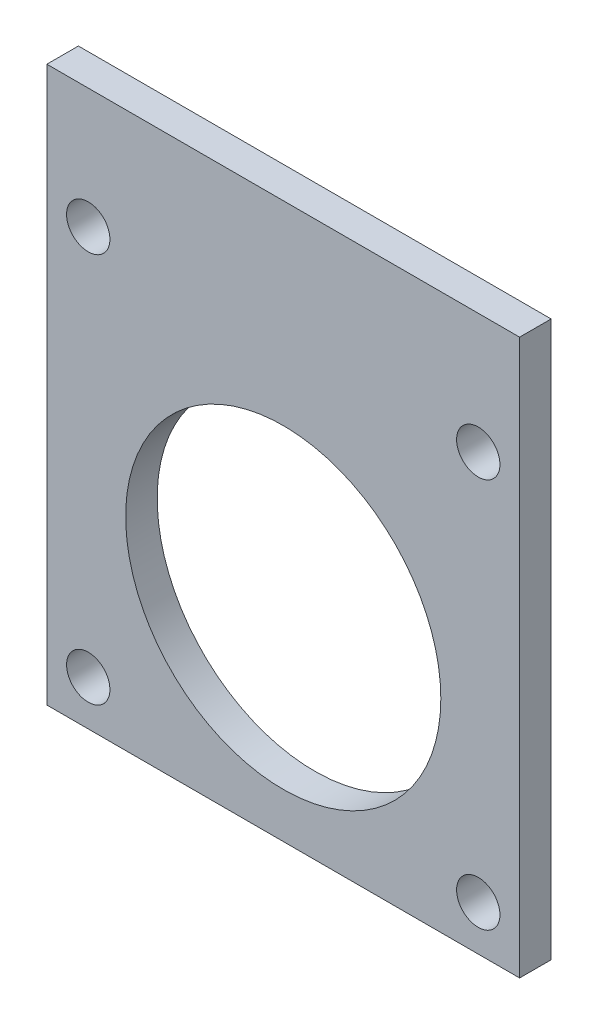
ISO-10303-21;
HEADER;
FILE_DESCRIPTION(('STEP AP214'),'2;1');
FILE_NAME('part.step','',(''),(''),'','','');
FILE_SCHEMA(('AUTOMOTIVE_DESIGN { 1 0 10303 214 1 1 1 1 }'));
ENDSEC;
DATA;
#1=APPLICATION_CONTEXT('core data for automotive mechanical design processes');
#2=APPLICATION_PROTOCOL_DEFINITION('international standard','automotive_design',2000,#1);
#3=PRODUCT_CONTEXT('',#1,'mechanical');
#4=PRODUCT('Part','Part','',(#3));
#5=PRODUCT_RELATED_PRODUCT_CATEGORY('part','',(#4));
#6=PRODUCT_DEFINITION_FORMATION('','',#4);
#7=PRODUCT_DEFINITION_CONTEXT('part definition',#1,'design');
#8=PRODUCT_DEFINITION('design','',#6,#7);
#9=PRODUCT_DEFINITION_SHAPE('','',#8);
#10=(LENGTH_UNIT() NAMED_UNIT(*) SI_UNIT(.MILLI.,.METRE.));
#11=(NAMED_UNIT(*) PLANE_ANGLE_UNIT() SI_UNIT($,.RADIAN.));
#12=(NAMED_UNIT(*) SI_UNIT($,.STERADIAN.) SOLID_ANGLE_UNIT());
#13=UNCERTAINTY_MEASURE_WITH_UNIT(LENGTH_MEASURE(1.E-05),#10,'distance_accuracy_value','');
#14=(GEOMETRIC_REPRESENTATION_CONTEXT(3) GLOBAL_UNCERTAINTY_ASSIGNED_CONTEXT((#13)) GLOBAL_UNIT_ASSIGNED_CONTEXT((#10,
#11,#12)) REPRESENTATION_CONTEXT('',''));
#15=CARTESIAN_POINT('',(0.,0.,0.));
#16=DIRECTION('',(0.,0.,1.));
#17=DIRECTION('',(1.,0.,0.));
#18=AXIS2_PLACEMENT_3D('',#15,#16,#17);
#19=CARTESIAN_POINT('',(0.,0.,4.));
#20=DIRECTION('',(0.,0.,1.));
#21=DIRECTION('',(1.,0.,0.));
#22=AXIS2_PLACEMENT_3D('',#19,#20,#21);
#23=PLANE('',#22);
#24=CARTESIAN_POINT('',(30.,-34.716194978299,4.));
#25=DIRECTION('',(0.,0.,1.));
#26=DIRECTION('',(1.,0.,0.));
#27=AXIS2_PLACEMENT_3D('',#24,#25,#26);
#28=CIRCLE('',#27,20.);
#29=CARTESIAN_POINT('',(50.,-34.716194978299,4.));
#30=VERTEX_POINT('',#29);
#31=EDGE_CURVE('E113',#30,#30,#28,.T.);
#32=ORIENTED_EDGE('',*,*,#31,.F.);
#33=EDGE_LOOP('',(#32));
#34=FACE_BOUND('',#33,.T.);
#35=CARTESIAN_POINT('',(5.25000000000001,-54.75,4.));
#36=DIRECTION('',(0.,0.,1.));
#37=DIRECTION('',(1.,0.,0.));
#38=AXIS2_PLACEMENT_3D('',#35,#36,#37);
#39=CIRCLE('',#38,2.75);
#40=CARTESIAN_POINT('',(8.00000000000001,-54.75,4.));
#41=VERTEX_POINT('',#40);
#42=EDGE_CURVE('E130',#41,#41,#39,.T.);
#43=ORIENTED_EDGE('',*,*,#42,.F.);
#44=EDGE_LOOP('',(#43));
#45=FACE_BOUND('',#44,.T.);
#46=CARTESIAN_POINT('',(5.24999999999999,-5.25,4.));
#47=DIRECTION('',(0.,0.,1.));
#48=DIRECTION('',(1.,0.,0.));
#49=AXIS2_PLACEMENT_3D('',#46,#47,#48);
#50=CIRCLE('',#49,2.75);
#51=CARTESIAN_POINT('',(7.99999999999999,-5.25,4.));
#52=VERTEX_POINT('',#51);
#53=EDGE_CURVE('E146',#52,#52,#50,.T.);
#54=ORIENTED_EDGE('',*,*,#53,.F.);
#55=EDGE_LOOP('',(#54));
#56=FACE_BOUND('',#55,.T.);
#57=DIRECTION('',(0.,-1.,0.));
#58=VECTOR('',#57,1.);
#59=CARTESIAN_POINT('',(0.,0.,4.));
#60=LINE('',#59,#58);
#61=CARTESIAN_POINT('',(0.,10.,4.));
#62=VERTEX_POINT('',#61);
#63=CARTESIAN_POINT('',(0.,-60.44,4.));
#64=VERTEX_POINT('',#63);
#65=EDGE_CURVE('E86',#62,#64,#60,.T.);
#66=ORIENTED_EDGE('',*,*,#65,.T.);
#67=DIRECTION('',(1.,0.,0.));
#68=VECTOR('',#67,1.);
#69=CARTESIAN_POINT('',(0.,-60.44,4.));
#70=LINE('',#69,#68);
#71=CARTESIAN_POINT('',(60.,-60.44,4.));
#72=VERTEX_POINT('',#71);
#73=EDGE_CURVE('E59',#64,#72,#70,.T.);
#74=ORIENTED_EDGE('',*,*,#73,.T.);
#75=DIRECTION('',(0.,1.,0.));
#76=VECTOR('',#75,1.);
#77=CARTESIAN_POINT('',(60.,0.,4.));
#78=LINE('',#77,#76);
#79=CARTESIAN_POINT('',(60.,10.,4.));
#80=VERTEX_POINT('',#79);
#81=EDGE_CURVE('E97',#72,#80,#78,.T.);
#82=ORIENTED_EDGE('',*,*,#81,.T.);
#83=DIRECTION('',(1.,0.,0.));
#84=VECTOR('',#83,1.);
#85=CARTESIAN_POINT('',(0.,10.,4.));
#86=LINE('',#85,#84);
#87=EDGE_CURVE('E94',#62,#80,#86,.T.);
#88=ORIENTED_EDGE('',*,*,#87,.F.);
#89=EDGE_LOOP('',(#66,#74,#82,#88));
#90=FACE_BOUND('',#89,.T.);
#91=CARTESIAN_POINT('',(54.75,-5.24999999999998,4.));
#92=DIRECTION('',(0.,0.,1.));
#93=DIRECTION('',(1.,0.,0.));
#94=AXIS2_PLACEMENT_3D('',#91,#92,#93);
#95=CIRCLE('',#94,2.75000000000001);
#96=CARTESIAN_POINT('',(57.5,-5.24999999999998,4.));
#97=VERTEX_POINT('',#96);
#98=EDGE_CURVE('E138',#97,#97,#95,.T.);
#99=ORIENTED_EDGE('',*,*,#98,.F.);
#100=EDGE_LOOP('',(#99));
#101=FACE_BOUND('',#100,.T.);
#102=CARTESIAN_POINT('',(54.75,-54.75,4.));
#103=DIRECTION('',(0.,0.,1.));
#104=DIRECTION('',(1.,0.,0.));
#105=AXIS2_PLACEMENT_3D('',#102,#103,#104);
#106=CIRCLE('',#105,2.75000000000001);
#107=CARTESIAN_POINT('',(57.5,-54.75,4.));
#108=VERTEX_POINT('',#107);
#109=EDGE_CURVE('E122',#108,#108,#106,.T.);
#110=ORIENTED_EDGE('',*,*,#109,.F.);
#111=EDGE_LOOP('',(#110));
#112=FACE_BOUND('',#111,.T.);
#113=ADVANCED_FACE('F41',(#34,#45,#56,#90,#101,#112),#23,.T.);
#114=CARTESIAN_POINT('',(0.,0.,0.));
#115=DIRECTION('',(0.,0.,1.));
#116=DIRECTION('',(1.,0.,0.));
#117=AXIS2_PLACEMENT_3D('',#114,#115,#116);
#118=PLANE('',#117);
#119=CARTESIAN_POINT('',(30.,-34.716194978299,0.));
#120=DIRECTION('',(0.,0.,1.));
#121=DIRECTION('',(1.,0.,0.));
#122=AXIS2_PLACEMENT_3D('',#119,#120,#121);
#123=CIRCLE('',#122,20.);
#124=CARTESIAN_POINT('',(50.,-34.716194978299,0.));
#125=VERTEX_POINT('',#124);
#126=EDGE_CURVE('E114',#125,#125,#123,.T.);
#127=ORIENTED_EDGE('',*,*,#126,.T.);
#128=EDGE_LOOP('',(#127));
#129=FACE_BOUND('',#128,.T.);
#130=DIRECTION('',(0.,-1.,0.));
#131=VECTOR('',#130,1.);
#132=CARTESIAN_POINT('',(0.,0.,0.));
#133=LINE('',#132,#131);
#134=CARTESIAN_POINT('',(0.,10.,0.));
#135=VERTEX_POINT('',#134);
#136=CARTESIAN_POINT('',(0.,-60.44,0.));
#137=VERTEX_POINT('',#136);
#138=EDGE_CURVE('E74',#135,#137,#133,.T.);
#139=ORIENTED_EDGE('',*,*,#138,.F.);
#140=DIRECTION('',(-1.,0.,0.));
#141=VECTOR('',#140,1.);
#142=CARTESIAN_POINT('',(0.,10.,0.));
#143=LINE('',#142,#141);
#144=CARTESIAN_POINT('',(60.,10.,0.));
#145=VERTEX_POINT('',#144);
#146=EDGE_CURVE('E105',#145,#135,#143,.T.);
#147=ORIENTED_EDGE('',*,*,#146,.F.);
#148=DIRECTION('',(0.,1.,0.));
#149=VECTOR('',#148,1.);
#150=CARTESIAN_POINT('',(60.,0.,0.));
#151=LINE('',#150,#149);
#152=CARTESIAN_POINT('',(60.,-60.44,0.));
#153=VERTEX_POINT('',#152);
#154=EDGE_CURVE('E91',#153,#145,#151,.T.);
#155=ORIENTED_EDGE('',*,*,#154,.F.);
#156=DIRECTION('',(1.,0.,0.));
#157=VECTOR('',#156,1.);
#158=CARTESIAN_POINT('',(0.,-60.44,0.));
#159=LINE('',#158,#157);
#160=EDGE_CURVE('E70',#137,#153,#159,.T.);
#161=ORIENTED_EDGE('',*,*,#160,.F.);
#162=EDGE_LOOP('',(#139,#147,#155,#161));
#163=FACE_BOUND('',#162,.T.);
#164=CARTESIAN_POINT('',(5.24999999999999,-5.25,0.));
#165=DIRECTION('',(0.,0.,1.));
#166=DIRECTION('',(1.,0.,0.));
#167=AXIS2_PLACEMENT_3D('',#164,#165,#166);
#168=CIRCLE('',#167,2.75);
#169=CARTESIAN_POINT('',(7.99999999999999,-5.25,0.));
#170=VERTEX_POINT('',#169);
#171=EDGE_CURVE('E142',#170,#170,#168,.T.);
#172=ORIENTED_EDGE('',*,*,#171,.T.);
#173=EDGE_LOOP('',(#172));
#174=FACE_BOUND('',#173,.T.);
#175=CARTESIAN_POINT('',(54.75,-5.24999999999998,0.));
#176=DIRECTION('',(0.,0.,1.));
#177=DIRECTION('',(1.,0.,0.));
#178=AXIS2_PLACEMENT_3D('',#175,#176,#177);
#179=CIRCLE('',#178,2.75000000000001);
#180=CARTESIAN_POINT('',(57.5,-5.24999999999998,0.));
#181=VERTEX_POINT('',#180);
#182=EDGE_CURVE('E134',#181,#181,#179,.T.);
#183=ORIENTED_EDGE('',*,*,#182,.T.);
#184=EDGE_LOOP('',(#183));
#185=FACE_BOUND('',#184,.T.);
#186=CARTESIAN_POINT('',(5.25000000000001,-54.75,0.));
#187=DIRECTION('',(0.,0.,1.));
#188=DIRECTION('',(1.,0.,0.));
#189=AXIS2_PLACEMENT_3D('',#186,#187,#188);
#190=CIRCLE('',#189,2.75);
#191=CARTESIAN_POINT('',(8.00000000000001,-54.75,0.));
#192=VERTEX_POINT('',#191);
#193=EDGE_CURVE('E126',#192,#192,#190,.T.);
#194=ORIENTED_EDGE('',*,*,#193,.T.);
#195=EDGE_LOOP('',(#194));
#196=FACE_BOUND('',#195,.T.);
#197=CARTESIAN_POINT('',(54.75,-54.75,0.));
#198=DIRECTION('',(0.,0.,1.));
#199=DIRECTION('',(1.,0.,0.));
#200=AXIS2_PLACEMENT_3D('',#197,#198,#199);
#201=CIRCLE('',#200,2.75000000000001);
#202=CARTESIAN_POINT('',(57.5,-54.75,0.));
#203=VERTEX_POINT('',#202);
#204=EDGE_CURVE('E118',#203,#203,#201,.T.);
#205=ORIENTED_EDGE('',*,*,#204,.T.);
#206=EDGE_LOOP('',(#205));
#207=FACE_BOUND('',#206,.T.);
#208=ADVANCED_FACE('F167',(#129,#163,#174,#185,#196,#207),#118,.F.);
#209=CARTESIAN_POINT('',(0.,0.,4.));
#210=DIRECTION('',(1.,0.,0.));
#211=DIRECTION('',(0.,1.,0.));
#212=AXIS2_PLACEMENT_3D('',#209,#210,#211);
#213=PLANE('',#212);
#214=ORIENTED_EDGE('',*,*,#138,.T.);
#215=DIRECTION('',(0.,0.,-1.));
#216=VECTOR('',#215,1.);
#217=CARTESIAN_POINT('',(0.,-60.44,4.));
#218=LINE('',#217,#216);
#219=EDGE_CURVE('E11',#64,#137,#218,.T.);
#220=ORIENTED_EDGE('',*,*,#219,.F.);
#221=ORIENTED_EDGE('',*,*,#65,.F.);
#222=DIRECTION('',(0.,0.,1.));
#223=VECTOR('',#222,1.);
#224=CARTESIAN_POINT('',(0.,10.,0.));
#225=LINE('',#224,#223);
#226=EDGE_CURVE('E89',#135,#62,#225,.T.);
#227=ORIENTED_EDGE('',*,*,#226,.F.);
#228=EDGE_LOOP('',(#214,#220,#221,#227));
#229=FACE_BOUND('',#228,.T.);
#230=ADVANCED_FACE('F43',(#229),#213,.F.);
#231=CARTESIAN_POINT('',(0.,-60.44,4.));
#232=DIRECTION('',(0.,1.,0.));
#233=DIRECTION('',(0.,0.,1.));
#234=AXIS2_PLACEMENT_3D('',#231,#232,#233);
#235=PLANE('',#234);
#236=ORIENTED_EDGE('',*,*,#160,.T.);
#237=DIRECTION('',(0.,0.,-1.));
#238=VECTOR('',#237,1.);
#239=CARTESIAN_POINT('',(60.,-60.44,4.));
#240=LINE('',#239,#238);
#241=EDGE_CURVE('E51',#72,#153,#240,.T.);
#242=ORIENTED_EDGE('',*,*,#241,.F.);
#243=ORIENTED_EDGE('',*,*,#73,.F.);
#244=ORIENTED_EDGE('',*,*,#219,.T.);
#245=EDGE_LOOP('',(#236,#242,#243,#244));
#246=FACE_BOUND('',#245,.T.);
#247=ADVANCED_FACE('F207',(#246),#235,.F.);
#248=CARTESIAN_POINT('',(60.,0.,4.));
#249=DIRECTION('',(-1.,0.,0.));
#250=DIRECTION('',(0.,-1.,0.));
#251=AXIS2_PLACEMENT_3D('',#248,#249,#250);
#252=PLANE('',#251);
#253=ORIENTED_EDGE('',*,*,#154,.T.);
#254=DIRECTION('',(0.,0.,-1.));
#255=VECTOR('',#254,1.);
#256=CARTESIAN_POINT('',(60.,10.,0.));
#257=LINE('',#256,#255);
#258=EDGE_CURVE('E102',#80,#145,#257,.T.);
#259=ORIENTED_EDGE('',*,*,#258,.F.);
#260=ORIENTED_EDGE('',*,*,#81,.F.);
#261=ORIENTED_EDGE('',*,*,#241,.T.);
#262=EDGE_LOOP('',(#253,#259,#260,#261));
#263=FACE_BOUND('',#262,.T.);
#264=ADVANCED_FACE('F165',(#263),#252,.F.);
#265=CARTESIAN_POINT('',(5.24999999999999,-5.25,4.));
#266=DIRECTION('',(0.,0.,-1.));
#267=DIRECTION('',(-1.,0.,0.));
#268=AXIS2_PLACEMENT_3D('',#265,#266,#267);
#269=CYLINDRICAL_SURFACE('',#268,2.75);
#270=ORIENTED_EDGE('',*,*,#53,.T.);
#271=EDGE_LOOP('',(#270));
#272=FACE_BOUND('',#271,.T.);
#273=ORIENTED_EDGE('',*,*,#171,.F.);
#274=EDGE_LOOP('',(#273));
#275=FACE_BOUND('',#274,.T.);
#276=ADVANCED_FACE('F203',(#272,#275),#269,.F.);
#277=CARTESIAN_POINT('',(54.75,-5.24999999999998,4.));
#278=DIRECTION('',(0.,0.,-1.));
#279=DIRECTION('',(-1.,0.,0.));
#280=AXIS2_PLACEMENT_3D('',#277,#278,#279);
#281=CYLINDRICAL_SURFACE('',#280,2.75000000000001);
#282=ORIENTED_EDGE('',*,*,#98,.T.);
#283=EDGE_LOOP('',(#282));
#284=FACE_BOUND('',#283,.T.);
#285=ORIENTED_EDGE('',*,*,#182,.F.);
#286=EDGE_LOOP('',(#285));
#287=FACE_BOUND('',#286,.T.);
#288=ADVANCED_FACE('F192',(#284,#287),#281,.F.);
#289=CARTESIAN_POINT('',(5.25000000000001,-54.75,4.));
#290=DIRECTION('',(0.,0.,-1.));
#291=DIRECTION('',(-1.,0.,0.));
#292=AXIS2_PLACEMENT_3D('',#289,#290,#291);
#293=CYLINDRICAL_SURFACE('',#292,2.75);
#294=ORIENTED_EDGE('',*,*,#42,.T.);
#295=EDGE_LOOP('',(#294));
#296=FACE_BOUND('',#295,.T.);
#297=ORIENTED_EDGE('',*,*,#193,.F.);
#298=EDGE_LOOP('',(#297));
#299=FACE_BOUND('',#298,.T.);
#300=ADVANCED_FACE('F183',(#296,#299),#293,.F.);
#301=CARTESIAN_POINT('',(54.75,-54.75,4.));
#302=DIRECTION('',(0.,0.,-1.));
#303=DIRECTION('',(-1.,0.,0.));
#304=AXIS2_PLACEMENT_3D('',#301,#302,#303);
#305=CYLINDRICAL_SURFACE('',#304,2.75000000000001);
#306=ORIENTED_EDGE('',*,*,#109,.T.);
#307=EDGE_LOOP('',(#306));
#308=FACE_BOUND('',#307,.T.);
#309=ORIENTED_EDGE('',*,*,#204,.F.);
#310=EDGE_LOOP('',(#309));
#311=FACE_BOUND('',#310,.T.);
#312=ADVANCED_FACE('F180',(#308,#311),#305,.F.);
#313=CARTESIAN_POINT('',(30.,-34.716194978299,0.));
#314=DIRECTION('',(0.,0.,1.));
#315=DIRECTION('',(1.,0.,0.));
#316=AXIS2_PLACEMENT_3D('',#313,#314,#315);
#317=CYLINDRICAL_SURFACE('',#316,20.);
#318=ORIENTED_EDGE('',*,*,#126,.F.);
#319=EDGE_LOOP('',(#318));
#320=FACE_BOUND('',#319,.T.);
#321=ORIENTED_EDGE('',*,*,#31,.T.);
#322=EDGE_LOOP('',(#321));
#323=FACE_BOUND('',#322,.T.);
#324=ADVANCED_FACE('F182',(#320,#323),#317,.F.);
#325=CARTESIAN_POINT('',(0.,10.,0.));
#326=DIRECTION('',(0.,1.,0.));
#327=DIRECTION('',(0.,0.,1.));
#328=AXIS2_PLACEMENT_3D('',#325,#326,#327);
#329=PLANE('',#328);
#330=ORIENTED_EDGE('',*,*,#226,.T.);
#331=ORIENTED_EDGE('',*,*,#87,.T.);
#332=ORIENTED_EDGE('',*,*,#258,.T.);
#333=ORIENTED_EDGE('',*,*,#146,.T.);
#334=EDGE_LOOP('',(#330,#331,#332,#333));
#335=FACE_BOUND('',#334,.T.);
#336=ADVANCED_FACE('F104',(#335),#329,.T.);
#337=CLOSED_SHELL('',(#113,#208,#230,#247,#264,#276,#288,#300,#312,#324,#336));
#338=MANIFOLD_SOLID_BREP('B2',#337);
#339=ADVANCED_BREP_SHAPE_REPRESENTATION('',(#18,#338),#14);
#340=SHAPE_DEFINITION_REPRESENTATION(#9,#339);
ENDSEC;
END-ISO-10303-21;
